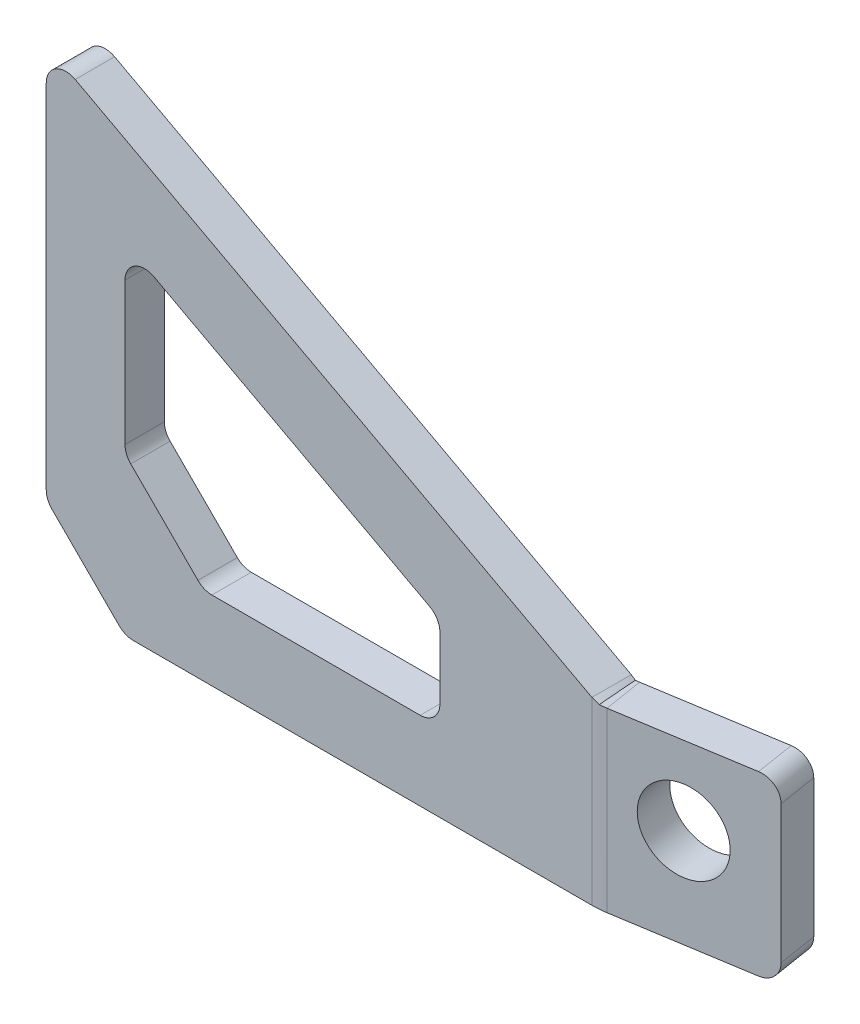
ISO-10303-21;
HEADER;
FILE_DESCRIPTION(('STEP AP214'),'2;1');
FILE_NAME('part.step','',(''),(''),'','','');
FILE_SCHEMA(('AUTOMOTIVE_DESIGN { 1 0 10303 214 1 1 1 1 }'));
ENDSEC;
DATA;
#1=APPLICATION_CONTEXT('core data for automotive mechanical design processes');
#2=APPLICATION_PROTOCOL_DEFINITION('international standard','automotive_design',2000,#1);
#3=PRODUCT_CONTEXT('',#1,'mechanical');
#4=PRODUCT('Part','Part','',(#3));
#5=PRODUCT_RELATED_PRODUCT_CATEGORY('part','',(#4));
#6=PRODUCT_DEFINITION_FORMATION('','',#4);
#7=PRODUCT_DEFINITION_CONTEXT('part definition',#1,'design');
#8=PRODUCT_DEFINITION('design','',#6,#7);
#9=PRODUCT_DEFINITION_SHAPE('','',#8);
#10=(LENGTH_UNIT() NAMED_UNIT(*) SI_UNIT(.MILLI.,.METRE.));
#11=(NAMED_UNIT(*) PLANE_ANGLE_UNIT() SI_UNIT($,.RADIAN.));
#12=(NAMED_UNIT(*) SI_UNIT($,.STERADIAN.) SOLID_ANGLE_UNIT());
#13=UNCERTAINTY_MEASURE_WITH_UNIT(LENGTH_MEASURE(1.E-05),#10,'distance_accuracy_value','');
#14=(GEOMETRIC_REPRESENTATION_CONTEXT(3) GLOBAL_UNCERTAINTY_ASSIGNED_CONTEXT((#13)) GLOBAL_UNIT_ASSIGNED_CONTEXT((#10,
#11,#12)) REPRESENTATION_CONTEXT('',''));
#15=CARTESIAN_POINT('',(0.,0.,0.));
#16=DIRECTION('',(0.,0.,1.));
#17=DIRECTION('',(1.,0.,0.));
#18=AXIS2_PLACEMENT_3D('',#15,#16,#17);
#19=CARTESIAN_POINT('',(88.4026185291436,28.575,-6.31050582149738));
#20=DIRECTION('',(0.,1.,0.));
#21=DIRECTION('',(0.157813385185794,0.,0.987468954173345));
#22=AXIS2_PLACEMENT_3D('',#19,#20,#21);
#23=PLANE('',#22);
#24=DIRECTION('',(-0.987468954173345,0.,0.157813385185794));
#25=VECTOR('',#24,1.);
#26=CARTESIAN_POINT('',(89.4047335250734,28.575,-0.0400779624966374));
#27=LINE('',#26,#25);
#28=CARTESIAN_POINT('',(111.351231031576,28.575,-3.54748044825091));
#29=VERTEX_POINT('',#28);
#30=CARTESIAN_POINT('',(90.2752249512932,28.575,-0.179196461530329));
#31=VERTEX_POINT('',#30);
#32=EDGE_CURVE('E260',#29,#31,#27,.T.);
#33=ORIENTED_EDGE('',*,*,#32,.F.);
#34=DIRECTION('',(0.157813385185794,0.,0.987468954173345));
#35=VECTOR('',#34,1.);
#36=CARTESIAN_POINT('',(110.349116035646,28.575,-9.81790830725165));
#37=LINE('',#36,#35);
#38=CARTESIAN_POINT('',(110.349116035646,28.575,-9.81790830725165));
#39=VERTEX_POINT('',#38);
#40=EDGE_CURVE('E312',#29,#39,#37,.F.);
#41=ORIENTED_EDGE('',*,*,#40,.T.);
#42=DIRECTION('',(-0.987468954173345,0.,0.157813385185794));
#43=VECTOR('',#42,1.);
#44=CARTESIAN_POINT('',(88.4026185291436,28.575,-6.31050582149738));
#45=LINE('',#44,#43);
#46=CARTESIAN_POINT('',(89.2731099553634,28.575,-6.44962432053107));
#47=VERTEX_POINT('',#46);
#48=EDGE_CURVE('E237',#39,#47,#45,.T.);
#49=ORIENTED_EDGE('',*,*,#48,.T.);
#50=DIRECTION('',(0.157813385185794,0.,0.987468954173345));
#51=VECTOR('',#50,1.);
#52=CARTESIAN_POINT('',(89.2731099553634,28.575,-6.44962432053107));
#53=LINE('',#52,#51);
#54=EDGE_CURVE('E270',#47,#31,#53,.T.);
#55=ORIENTED_EDGE('',*,*,#54,.T.);
#56=EDGE_LOOP('',(#33,#41,#49,#55));
#57=FACE_BOUND('',#56,.T.);
#58=ADVANCED_FACE('F55',(#57),#23,.T.);
#59=CARTESIAN_POINT('',(113.484329965147,0.,-10.3189658052165));
#60=DIRECTION('',(0.,-1.,0.));
#61=DIRECTION('',(-0.157813385185794,0.,-0.987468954173345));
#62=AXIS2_PLACEMENT_3D('',#59,#60,#61);
#63=PLANE('',#62);
#64=DIRECTION('',(0.987468954173345,0.,-0.157813385185794));
#65=VECTOR('',#64,1.);
#66=CARTESIAN_POINT('',(113.484329965147,0.,-10.3189658052165));
#67=LINE('',#66,#65);
#68=CARTESIAN_POINT('',(89.2731099553634,0.,-6.44962432053107));
#69=VERTEX_POINT('',#68);
#70=CARTESIAN_POINT('',(110.349116035646,0.,-9.81790830725165));
#71=VERTEX_POINT('',#70);
#72=EDGE_CURVE('E251',#69,#71,#67,.T.);
#73=ORIENTED_EDGE('',*,*,#72,.T.);
#74=DIRECTION('',(0.157813385185794,0.,0.987468954173345));
#75=VECTOR('',#74,1.);
#76=CARTESIAN_POINT('',(110.349116035646,0.,-9.81790830725165));
#77=LINE('',#76,#75);
#78=CARTESIAN_POINT('',(111.351231031576,0.,-3.54748044825091));
#79=VERTEX_POINT('',#78);
#80=EDGE_CURVE('E298',#71,#79,#77,.T.);
#81=ORIENTED_EDGE('',*,*,#80,.T.);
#82=DIRECTION('',(0.987468954173345,0.,-0.157813385185794));
#83=VECTOR('',#82,1.);
#84=CARTESIAN_POINT('',(114.486444961076,0.,-4.0485379462158));
#85=LINE('',#84,#83);
#86=CARTESIAN_POINT('',(90.2752249512932,0.,-0.179196461530329));
#87=VERTEX_POINT('',#86);
#88=EDGE_CURVE('E265',#87,#79,#85,.T.);
#89=ORIENTED_EDGE('',*,*,#88,.F.);
#90=DIRECTION('',(-0.157813385185794,0.,-0.987468954173345));
#91=VECTOR('',#90,1.);
#92=CARTESIAN_POINT('',(89.2731099553634,0.,-6.44962432053107));
#93=LINE('',#92,#91);
#94=EDGE_CURVE('E236',#87,#69,#93,.T.);
#95=ORIENTED_EDGE('',*,*,#94,.T.);
#96=EDGE_LOOP('',(#73,#81,#89,#95));
#97=FACE_BOUND('',#96,.T.);
#98=ADVANCED_FACE('F263',(#97),#63,.T.);
#99=CARTESIAN_POINT('',(0.616628503133213,0.,7.7191041215197));
#100=DIRECTION('',(-0.157813385185794,0.,-0.987468954173345));
#101=DIRECTION('',(-0.987468954173345,0.,0.157813385185794));
#102=AXIS2_PLACEMENT_3D('',#99,#100,#101);
#103=PLANE('',#102);
#104=CARTESIAN_POINT('',(99.940205789705,15.9258,-8.1543974140082));
#105=DIRECTION('',(-0.157813385185794,0.,-0.987468954173345));
#106=DIRECTION('',(-0.987468954173345,0.,0.157813385185794));
#107=AXIS2_PLACEMENT_3D('',#104,#105,#106);
#108=CIRCLE('',#107,6.54843750000001);
#109=CARTESIAN_POINT('',(93.4738270601105,15.9258,-7.1209663244556));
#110=VERTEX_POINT('',#109);
#111=EDGE_CURVE('E286',#110,#110,#108,.T.);
#112=ORIENTED_EDGE('',*,*,#111,.F.);
#113=EDGE_LOOP('',(#112));
#114=FACE_BOUND('',#113,.T.);
#115=DIRECTION('',(0.,1.,0.));
#116=VECTOR('',#115,1.);
#117=CARTESIAN_POINT('',(113.484329965147,28.575,-10.3189658052165));
#118=LINE('',#117,#116);
#119=CARTESIAN_POINT('',(113.484329965147,3.175,-10.3189658052165));
#120=VERTEX_POINT('',#119);
#121=CARTESIAN_POINT('',(113.484329965147,25.4,-10.3189658052165));
#122=VERTEX_POINT('',#121);
#123=EDGE_CURVE('E259',#120,#122,#118,.T.);
#124=ORIENTED_EDGE('',*,*,#123,.F.);
#125=CARTESIAN_POINT('',(110.349116035646,3.175,-9.81790830725165));
#126=DIRECTION('',(-0.157813385185794,0.,-0.987468954173345));
#127=DIRECTION('',(-0.987468954173345,0.,0.157813385185794));
#128=AXIS2_PLACEMENT_3D('',#125,#126,#127);
#129=CIRCLE('',#128,3.175);
#130=EDGE_CURVE('E255',#120,#71,#129,.T.);
#131=ORIENTED_EDGE('',*,*,#130,.T.);
#132=ORIENTED_EDGE('',*,*,#72,.F.);
#133=DIRECTION('',(0.,1.,0.));
#134=VECTOR('',#133,1.);
#135=CARTESIAN_POINT('',(89.2731099553634,0.,-6.44962432053107));
#136=LINE('',#135,#134);
#137=EDGE_CURVE('E224',#69,#47,#136,.T.);
#138=ORIENTED_EDGE('',*,*,#137,.T.);
#139=ORIENTED_EDGE('',*,*,#48,.F.);
#140=CARTESIAN_POINT('',(110.349116035646,25.4,-9.81790830725165));
#141=DIRECTION('',(-0.157813385185794,0.,-0.987468954173345));
#142=DIRECTION('',(-0.987468954173345,0.,0.157813385185794));
#143=AXIS2_PLACEMENT_3D('',#140,#141,#142);
#144=CIRCLE('',#143,3.175);
#145=EDGE_CURVE('E309',#39,#122,#144,.T.);
#146=ORIENTED_EDGE('',*,*,#145,.T.);
#147=EDGE_LOOP('',(#124,#131,#132,#138,#139,#146));
#148=FACE_BOUND('',#147,.T.);
#149=ADVANCED_FACE('F253',(#114,#148),#103,.T.);
#150=CARTESIAN_POINT('',(113.484329965147,28.575,-10.3189658052165));
#151=DIRECTION('',(0.987468954173345,0.,-0.157813385185794));
#152=DIRECTION('',(0.,1.,0.));
#153=AXIS2_PLACEMENT_3D('',#150,#151,#152);
#154=PLANE('',#153);
#155=DIRECTION('',(0.,1.,0.));
#156=VECTOR('',#155,1.);
#157=CARTESIAN_POINT('',(114.486444961076,28.575,-4.0485379462158));
#158=LINE('',#157,#156);
#159=CARTESIAN_POINT('',(114.486444961076,3.175,-4.0485379462158));
#160=VERTEX_POINT('',#159);
#161=CARTESIAN_POINT('',(114.486444961076,25.4,-4.0485379462158));
#162=VERTEX_POINT('',#161);
#163=EDGE_CURVE('E279',#160,#162,#158,.T.);
#164=ORIENTED_EDGE('',*,*,#163,.F.);
#165=DIRECTION('',(0.157813385185794,0.,0.987468954173345));
#166=VECTOR('',#165,1.);
#167=CARTESIAN_POINT('',(113.484329965147,3.175,-10.3189658052165));
#168=LINE('',#167,#166);
#169=EDGE_CURVE('E307',#160,#120,#168,.F.);
#170=ORIENTED_EDGE('',*,*,#169,.T.);
#171=ORIENTED_EDGE('',*,*,#123,.T.);
#172=DIRECTION('',(0.157813385185794,0.,0.987468954173345));
#173=VECTOR('',#172,1.);
#174=CARTESIAN_POINT('',(113.484329965147,25.4,-10.3189658052165));
#175=LINE('',#174,#173);
#176=EDGE_CURVE('E304',#122,#162,#175,.T.);
#177=ORIENTED_EDGE('',*,*,#176,.T.);
#178=EDGE_LOOP('',(#164,#170,#171,#177));
#179=FACE_BOUND('',#178,.T.);
#180=ADVANCED_FACE('F462',(#179),#154,.T.);
#181=CARTESIAN_POINT('',(1.618743499063,0.,13.9895319805204));
#182=DIRECTION('',(-0.157813385185794,0.,-0.987468954173345));
#183=DIRECTION('',(-0.987468954173345,0.,0.157813385185794));
#184=AXIS2_PLACEMENT_3D('',#181,#182,#183);
#185=PLANE('',#184);
#186=CARTESIAN_POINT('',(100.942320785635,15.9258,-1.88396955500745));
#187=DIRECTION('',(-0.157813385185794,0.,-0.987468954173345));
#188=DIRECTION('',(-0.987468954173345,0.,0.157813385185794));
#189=AXIS2_PLACEMENT_3D('',#186,#187,#188);
#190=CIRCLE('',#189,6.54843750000001);
#191=CARTESIAN_POINT('',(94.4759420560403,15.9258,-0.850538465454855));
#192=VERTEX_POINT('',#191);
#193=EDGE_CURVE('E282',#192,#192,#190,.T.);
#194=ORIENTED_EDGE('',*,*,#193,.T.);
#195=EDGE_LOOP('',(#194));
#196=FACE_BOUND('',#195,.T.);
#197=ORIENTED_EDGE('',*,*,#88,.T.);
#198=CARTESIAN_POINT('',(111.351231031576,3.175,-3.54748044825091));
#199=DIRECTION('',(-0.157813385185794,0.,-0.987468954173345));
#200=DIRECTION('',(-0.987468954173345,0.,0.157813385185794));
#201=AXIS2_PLACEMENT_3D('',#198,#199,#200);
#202=CIRCLE('',#201,3.175);
#203=EDGE_CURVE('E302',#79,#160,#202,.F.);
#204=ORIENTED_EDGE('',*,*,#203,.T.);
#205=ORIENTED_EDGE('',*,*,#163,.T.);
#206=CARTESIAN_POINT('',(111.351231031576,25.4,-3.54748044825091));
#207=DIRECTION('',(-0.157813385185794,0.,-0.987468954173345));
#208=DIRECTION('',(-0.987468954173345,0.,0.157813385185794));
#209=AXIS2_PLACEMENT_3D('',#206,#207,#208);
#210=CIRCLE('',#209,3.175);
#211=EDGE_CURVE('E300',#162,#29,#210,.F.);
#212=ORIENTED_EDGE('',*,*,#211,.T.);
#213=ORIENTED_EDGE('',*,*,#32,.T.);
#214=DIRECTION('',(0.,1.,0.));
#215=VECTOR('',#214,1.);
#216=CARTESIAN_POINT('',(90.2752249512932,0.,-0.179196461530327));
#217=LINE('',#216,#215);
#218=EDGE_CURVE('E267',#87,#31,#217,.T.);
#219=ORIENTED_EDGE('',*,*,#218,.F.);
#220=EDGE_LOOP('',(#197,#204,#205,#212,#213,#219));
#221=FACE_BOUND('',#220,.T.);
#222=ADVANCED_FACE('F465',(#196,#221),#185,.F.);
#223=CARTESIAN_POINT('',(63.5,12.7,-6.35));
#224=DIRECTION('',(1.,0.,0.));
#225=DIRECTION('',(0.,0.,-1.));
#226=AXIS2_PLACEMENT_3D('',#223,#224,#225);
#227=PLANE('',#226);
#228=DIRECTION('',(0.,1.,0.));
#229=VECTOR('',#228,1.);
#230=CARTESIAN_POINT('',(63.5,12.7,-6.35));
#231=LINE('',#230,#229);
#232=CARTESIAN_POINT('',(63.5,15.875,-6.35));
#233=VERTEX_POINT('',#232);
#234=CARTESIAN_POINT('',(63.5,25.8735510523919,-6.35));
#235=VERTEX_POINT('',#234);
#236=EDGE_CURVE('E402',#233,#235,#231,.T.);
#237=ORIENTED_EDGE('',*,*,#236,.F.);
#238=DIRECTION('',(0.,0.,1.));
#239=VECTOR('',#238,1.);
#240=CARTESIAN_POINT('',(63.5,15.875,0.));
#241=LINE('',#240,#239);
#242=CARTESIAN_POINT('',(63.5,15.875,0.));
#243=VERTEX_POINT('',#242);
#244=EDGE_CURVE('E342',#233,#243,#241,.T.);
#245=ORIENTED_EDGE('',*,*,#244,.T.);
#246=DIRECTION('',(0.,1.,0.));
#247=VECTOR('',#246,1.);
#248=CARTESIAN_POINT('',(63.5,12.7,0.));
#249=LINE('',#248,#247);
#250=CARTESIAN_POINT('',(63.5,25.8735510523919,0.));
#251=VERTEX_POINT('',#250);
#252=EDGE_CURVE('E424',#243,#251,#249,.T.);
#253=ORIENTED_EDGE('',*,*,#252,.T.);
#254=DIRECTION('',(0.,0.,1.));
#255=VECTOR('',#254,1.);
#256=CARTESIAN_POINT('',(63.5,25.8735510523919,-6.35));
#257=LINE('',#256,#255);
#258=EDGE_CURVE('E70',#251,#235,#257,.F.);
#259=ORIENTED_EDGE('',*,*,#258,.T.);
#260=EDGE_LOOP('',(#237,#245,#253,#259));
#261=FACE_BOUND('',#260,.T.);
#262=ADVANCED_FACE('F474',(#261),#227,.F.);
#263=CARTESIAN_POINT('',(12.7,12.7,-6.35));
#264=DIRECTION('',(0.,-1.,0.));
#265=DIRECTION('',(1.,0.,0.));
#266=AXIS2_PLACEMENT_3D('',#263,#264,#265);
#267=PLANE('',#266);
#268=DIRECTION('',(1.,0.,0.));
#269=VECTOR('',#268,1.);
#270=CARTESIAN_POINT('',(12.7,12.7,0.));
#271=LINE('',#270,#269);
#272=CARTESIAN_POINT('',(26.7151280605346,12.7,0.));
#273=VERTEX_POINT('',#272);
#274=CARTESIAN_POINT('',(60.325,12.7,0.));
#275=VERTEX_POINT('',#274);
#276=EDGE_CURVE('E387',#273,#275,#271,.T.);
#277=ORIENTED_EDGE('',*,*,#276,.T.);
#278=DIRECTION('',(0.,0.,1.));
#279=VECTOR('',#278,1.);
#280=CARTESIAN_POINT('',(60.325,12.7,-6.35));
#281=LINE('',#280,#279);
#282=CARTESIAN_POINT('',(60.325,12.7,-6.35));
#283=VERTEX_POINT('',#282);
#284=EDGE_CURVE('E348',#275,#283,#281,.F.);
#285=ORIENTED_EDGE('',*,*,#284,.T.);
#286=DIRECTION('',(1.,0.,0.));
#287=VECTOR('',#286,1.);
#288=CARTESIAN_POINT('',(12.7,12.7,-6.35));
#289=LINE('',#288,#287);
#290=CARTESIAN_POINT('',(26.7151280605346,12.7,-6.35));
#291=VERTEX_POINT('',#290);
#292=EDGE_CURVE('E398',#291,#283,#289,.T.);
#293=ORIENTED_EDGE('',*,*,#292,.F.);
#294=DIRECTION('',(0.,0.,-1.));
#295=VECTOR('',#294,1.);
#296=CARTESIAN_POINT('',(26.7151280605346,12.7,0.));
#297=LINE('',#296,#295);
#298=EDGE_CURVE('E345',#291,#273,#297,.F.);
#299=ORIENTED_EDGE('',*,*,#298,.T.);
#300=EDGE_LOOP('',(#277,#285,#293,#299));
#301=FACE_BOUND('',#300,.T.);
#302=ADVANCED_FACE('F400',(#301),#267,.F.);
#303=CARTESIAN_POINT('',(12.7,54.9888408419135,-6.35));
#304=DIRECTION('',(-1.,0.,0.));
#305=DIRECTION('',(0.,-1.,0.));
#306=AXIS2_PLACEMENT_3D('',#303,#304,#305);
#307=PLANE('',#306);
#308=DIRECTION('',(0.,-1.,0.));
#309=VECTOR('',#308,1.);
#310=CARTESIAN_POINT('',(12.7,54.9888408419135,-6.35));
#311=LINE('',#310,#309);
#312=CARTESIAN_POINT('',(12.7,49.6860510523919,-6.35));
#313=VERTEX_POINT('',#312);
#314=CARTESIAN_POINT('',(12.7,26.7151280605345,-6.35));
#315=VERTEX_POINT('',#314);
#316=EDGE_CURVE('E403',#313,#315,#311,.T.);
#317=ORIENTED_EDGE('',*,*,#316,.F.);
#318=DIRECTION('',(0.,0.,1.));
#319=VECTOR('',#318,1.);
#320=CARTESIAN_POINT('',(12.7,49.6860510523919,0.));
#321=LINE('',#320,#319);
#322=CARTESIAN_POINT('',(12.7,49.6860510523919,0.));
#323=VERTEX_POINT('',#322);
#324=EDGE_CURVE('E358',#313,#323,#321,.T.);
#325=ORIENTED_EDGE('',*,*,#324,.T.);
#326=DIRECTION('',(0.,-1.,0.));
#327=VECTOR('',#326,1.);
#328=CARTESIAN_POINT('',(12.7,54.9888408419135,0.));
#329=LINE('',#328,#327);
#330=CARTESIAN_POINT('',(12.7,26.7151280605345,0.));
#331=VERTEX_POINT('',#330);
#332=EDGE_CURVE('E420',#323,#331,#329,.T.);
#333=ORIENTED_EDGE('',*,*,#332,.T.);
#334=DIRECTION('',(0.,0.,1.));
#335=VECTOR('',#334,1.);
#336=CARTESIAN_POINT('',(12.7,26.7151280605345,-6.35));
#337=LINE('',#336,#335);
#338=EDGE_CURVE('E355',#331,#315,#337,.F.);
#339=ORIENTED_EDGE('',*,*,#338,.T.);
#340=EDGE_LOOP('',(#317,#325,#333,#339));
#341=FACE_BOUND('',#340,.T.);
#342=ADVANCED_FACE('F526',(#341),#307,.F.);
#343=CARTESIAN_POINT('',(63.5,27.7745551276278,-6.35));
#344=DIRECTION('',(0.472221412515419,0.881479970028782,0.));
#345=DIRECTION('',(-0.881479970028782,0.472221412515419,0.));
#346=AXIS2_PLACEMENT_3D('',#343,#344,#345);
#347=PLANE('',#346);
#348=DIRECTION('',(-0.881479970028782,0.472221412515419,0.));
#349=VECTOR('',#348,1.);
#350=CARTESIAN_POINT('',(63.5,27.7745551276278,-6.35));
#351=LINE('',#350,#349);
#352=CARTESIAN_POINT('',(61.8243029847365,28.6722499572332,-6.35));
#353=VERTEX_POINT('',#352);
#354=CARTESIAN_POINT('',(17.3743029847364,52.4847499572332,-6.35));
#355=VERTEX_POINT('',#354);
#356=EDGE_CURVE('E408',#353,#355,#351,.T.);
#357=ORIENTED_EDGE('',*,*,#356,.F.);
#358=DIRECTION('',(0.,0.,1.));
#359=VECTOR('',#358,1.);
#360=CARTESIAN_POINT('',(61.8243029847365,28.6722499572332,0.));
#361=LINE('',#360,#359);
#362=CARTESIAN_POINT('',(61.8243029847365,28.6722499572332,0.));
#363=VERTEX_POINT('',#362);
#364=EDGE_CURVE('E352',#353,#363,#361,.T.);
#365=ORIENTED_EDGE('',*,*,#364,.T.);
#366=DIRECTION('',(-0.881479970028782,0.472221412515419,0.));
#367=VECTOR('',#366,1.);
#368=CARTESIAN_POINT('',(63.5,27.7745551276278,0.));
#369=LINE('',#368,#367);
#370=CARTESIAN_POINT('',(17.3743029847364,52.4847499572332,0.));
#371=VERTEX_POINT('',#370);
#372=EDGE_CURVE('E417',#363,#371,#369,.T.);
#373=ORIENTED_EDGE('',*,*,#372,.T.);
#374=DIRECTION('',(0.,0.,1.));
#375=VECTOR('',#374,1.);
#376=CARTESIAN_POINT('',(17.3743029847364,52.4847499572332,-6.35));
#377=LINE('',#376,#375);
#378=EDGE_CURVE('E350',#371,#355,#377,.F.);
#379=ORIENTED_EDGE('',*,*,#378,.T.);
#380=EDGE_LOOP('',(#357,#365,#373,#379));
#381=FACE_BOUND('',#380,.T.);
#382=ADVANCED_FACE('F533',(#381),#347,.F.);
#383=CARTESIAN_POINT('',(0.,0.,-6.35));
#384=DIRECTION('',(-1.,0.,0.));
#385=DIRECTION('',(0.,0.,1.));
#386=AXIS2_PLACEMENT_3D('',#383,#384,#385);
#387=PLANE('',#386);
#388=DIRECTION('',(0.,-1.,0.));
#389=VECTOR('',#388,1.);
#390=CARTESIAN_POINT('',(0.,0.,0.));
#391=LINE('',#390,#389);
#392=CARTESIAN_POINT('',(0.,70.8972102104783,0.));
#393=VERTEX_POINT('',#392);
#394=CARTESIAN_POINT('',(0.,14.0151280605346,0.));
#395=VERTEX_POINT('',#394);
#396=EDGE_CURVE('E431',#393,#395,#391,.T.);
#397=ORIENTED_EDGE('',*,*,#396,.F.);
#398=DIRECTION('',(0.,0.,1.));
#399=VECTOR('',#398,1.);
#400=CARTESIAN_POINT('',(0.,70.8972102104784,-6.35));
#401=LINE('',#400,#399);
#402=CARTESIAN_POINT('',(0.,70.8972102104783,-6.35));
#403=VERTEX_POINT('',#402);
#404=EDGE_CURVE('E326',#393,#403,#401,.F.);
#405=ORIENTED_EDGE('',*,*,#404,.T.);
#406=DIRECTION('',(0.,-1.,0.));
#407=VECTOR('',#406,1.);
#408=CARTESIAN_POINT('',(0.,0.,-6.35));
#409=LINE('',#408,#407);
#410=CARTESIAN_POINT('',(0.,14.0151280605346,-6.35));
#411=VERTEX_POINT('',#410);
#412=EDGE_CURVE('E414',#403,#411,#409,.T.);
#413=ORIENTED_EDGE('',*,*,#412,.T.);
#414=DIRECTION('',(0.,0.,-1.));
#415=VECTOR('',#414,1.);
#416=CARTESIAN_POINT('',(0.,14.0151280605346,-6.35));
#417=LINE('',#416,#415);
#418=EDGE_CURVE('E323',#411,#395,#417,.F.);
#419=ORIENTED_EDGE('',*,*,#418,.T.);
#420=EDGE_LOOP('',(#397,#405,#413,#419));
#421=FACE_BOUND('',#420,.T.);
#422=ADVANCED_FACE('F553',(#421),#387,.T.);
#423=CARTESIAN_POINT('',(0.,0.,-6.35));
#424=DIRECTION('',(0.,0.,-1.));
#425=DIRECTION('',(-1.,0.,0.));
#426=AXIS2_PLACEMENT_3D('',#423,#424,#425);
#427=PLANE('',#426);
#428=ORIENTED_EDGE('',*,*,#412,.F.);
#429=CARTESIAN_POINT('',(3.175,70.8972102104784,-6.35));
#430=DIRECTION('',(0.,0.,-1.));
#431=DIRECTION('',(-1.,0.,0.));
#432=AXIS2_PLACEMENT_3D('',#429,#430,#431);
#433=CIRCLE('',#432,3.175);
#434=CARTESIAN_POINT('',(4.67430298473646,73.6959091153198,-6.35));
#435=VERTEX_POINT('',#434);
#436=EDGE_CURVE('E332',#403,#435,#433,.T.);
#437=ORIENTED_EDGE('',*,*,#436,.T.);
#438=DIRECTION('',(-0.881479970028782,0.472221412515419,0.));
#439=VECTOR('',#438,1.);
#440=CARTESIAN_POINT('',(0.,76.2,-6.35));
#441=LINE('',#440,#439);
#442=CARTESIAN_POINT('',(88.0184619804593,29.0472525104682,-6.35));
#443=VERTEX_POINT('',#442);
#444=EDGE_CURVE('E280',#443,#435,#441,.T.);
#445=ORIENTED_EDGE('',*,*,#444,.F.);
#446=DIRECTION('',(0.,1.,0.));
#447=VECTOR('',#446,1.);
#448=CARTESIAN_POINT('',(88.0184619804593,0.,-6.35));
#449=LINE('',#448,#447);
#450=CARTESIAN_POINT('',(88.0184619804593,0.,-6.35));
#451=VERTEX_POINT('',#450);
#452=EDGE_CURVE('E449',#451,#443,#449,.T.);
#453=ORIENTED_EDGE('',*,*,#452,.F.);
#454=DIRECTION('',(1.,0.,0.));
#455=VECTOR('',#454,1.);
#456=CARTESIAN_POINT('',(114.3,0.,-6.35));
#457=LINE('',#456,#455);
#458=CARTESIAN_POINT('',(14.0151280605346,0.,-6.35));
#459=VERTEX_POINT('',#458);
#460=EDGE_CURVE('E405',#459,#451,#457,.T.);
#461=ORIENTED_EDGE('',*,*,#460,.F.);
#462=CARTESIAN_POINT('',(14.0151280605346,3.175,-6.35));
#463=DIRECTION('',(0.,0.,-1.));
#464=DIRECTION('',(-1.,0.,0.));
#465=AXIS2_PLACEMENT_3D('',#462,#463,#464);
#466=CIRCLE('',#465,3.175);
#467=CARTESIAN_POINT('',(11.7700640302673,0.929935969732714,-6.35));
#468=VERTEX_POINT('',#467);
#469=EDGE_CURVE('E328',#459,#468,#466,.T.);
#470=ORIENTED_EDGE('',*,*,#469,.T.);
#471=DIRECTION('',(0.707106781186549,-0.707106781186546,0.));
#472=VECTOR('',#471,1.);
#473=CARTESIAN_POINT('',(6.34999999999999,6.35000000000002,-6.35));
#474=LINE('',#473,#472);
#475=CARTESIAN_POINT('',(0.929935969732714,11.7700640302673,-6.35));
#476=VERTEX_POINT('',#475);
#477=EDGE_CURVE('E289',#468,#476,#474,.F.);
#478=ORIENTED_EDGE('',*,*,#477,.T.);
#479=CARTESIAN_POINT('',(3.175,14.0151280605346,-6.35));
#480=DIRECTION('',(0.,0.,-1.));
#481=DIRECTION('',(-1.,0.,0.));
#482=AXIS2_PLACEMENT_3D('',#479,#480,#481);
#483=CIRCLE('',#482,3.175);
#484=EDGE_CURVE('E330',#476,#411,#483,.T.);
#485=ORIENTED_EDGE('',*,*,#484,.T.);
#486=EDGE_LOOP('',(#428,#437,#445,#453,#461,#470,#478,#485));
#487=FACE_BOUND('',#486,.T.);
#488=ORIENTED_EDGE('',*,*,#236,.T.);
#489=CARTESIAN_POINT('',(60.325,25.8735510523919,-6.35));
#490=DIRECTION('',(0.,0.,-1.));
#491=DIRECTION('',(-1.,0.,0.));
#492=AXIS2_PLACEMENT_3D('',#489,#490,#491);
#493=CIRCLE('',#492,3.175);
#494=EDGE_CURVE('E370',#235,#353,#493,.F.);
#495=ORIENTED_EDGE('',*,*,#494,.T.);
#496=ORIENTED_EDGE('',*,*,#356,.T.);
#497=CARTESIAN_POINT('',(15.875,49.6860510523919,-6.35));
#498=DIRECTION('',(0.,0.,-1.));
#499=DIRECTION('',(-1.,0.,0.));
#500=AXIS2_PLACEMENT_3D('',#497,#498,#499);
#501=CIRCLE('',#500,3.175);
#502=EDGE_CURVE('E374',#355,#313,#501,.F.);
#503=ORIENTED_EDGE('',*,*,#502,.T.);
#504=ORIENTED_EDGE('',*,*,#316,.T.);
#505=CARTESIAN_POINT('',(15.875,26.7151280605345,-6.35));
#506=DIRECTION('',(0.,0.,-1.));
#507=DIRECTION('',(-1.,0.,0.));
#508=AXIS2_PLACEMENT_3D('',#505,#506,#507);
#509=CIRCLE('',#508,3.175);
#510=CARTESIAN_POINT('',(13.6299359697327,24.4700640302672,-6.35));
#511=VERTEX_POINT('',#510);
#512=EDGE_CURVE('E376',#315,#511,#509,.F.);
#513=ORIENTED_EDGE('',*,*,#512,.T.);
#514=DIRECTION('',(-0.707106781186551,0.707106781186544,0.));
#515=VECTOR('',#514,1.);
#516=CARTESIAN_POINT('',(25.4000000000001,12.7,-6.35));
#517=LINE('',#516,#515);
#518=CARTESIAN_POINT('',(24.4700640302674,13.6299359697327,-6.35));
#519=VERTEX_POINT('',#518);
#520=EDGE_CURVE('E295',#511,#519,#517,.F.);
#521=ORIENTED_EDGE('',*,*,#520,.T.);
#522=CARTESIAN_POINT('',(26.7151280605346,15.875,-6.35));
#523=DIRECTION('',(0.,0.,-1.));
#524=DIRECTION('',(-1.,0.,0.));
#525=AXIS2_PLACEMENT_3D('',#522,#523,#524);
#526=CIRCLE('',#525,3.175);
#527=EDGE_CURVE('E12',#519,#291,#526,.F.);
#528=ORIENTED_EDGE('',*,*,#527,.T.);
#529=ORIENTED_EDGE('',*,*,#292,.T.);
#530=CARTESIAN_POINT('',(60.325,15.875,-6.35));
#531=DIRECTION('',(0.,0.,-1.));
#532=DIRECTION('',(-1.,0.,0.));
#533=AXIS2_PLACEMENT_3D('',#530,#531,#532);
#534=CIRCLE('',#533,3.175);
#535=EDGE_CURVE('E77',#283,#233,#534,.F.);
#536=ORIENTED_EDGE('',*,*,#535,.T.);
#537=EDGE_LOOP('',(#488,#495,#496,#503,#504,#513,#521,#528,#529,#536));
#538=FACE_BOUND('',#537,.T.);
#539=ADVANCED_FACE('F397',(#487,#538),#427,.T.);
#540=CARTESIAN_POINT('',(114.3,0.,-6.35));
#541=DIRECTION('',(0.,-1.,0.));
#542=DIRECTION('',(0.,0.,-1.));
#543=AXIS2_PLACEMENT_3D('',#540,#541,#542);
#544=PLANE('',#543);
#545=DIRECTION('',(1.,0.,0.));
#546=VECTOR('',#545,1.);
#547=CARTESIAN_POINT('',(114.3,0.,0.));
#548=LINE('',#547,#546);
#549=CARTESIAN_POINT('',(14.0151280605346,0.,0.));
#550=VERTEX_POINT('',#549);
#551=CARTESIAN_POINT('',(88.0184619804593,0.,0.));
#552=VERTEX_POINT('',#551);
#553=EDGE_CURVE('E437',#550,#552,#548,.T.);
#554=ORIENTED_EDGE('',*,*,#553,.F.);
#555=DIRECTION('',(0.,0.,1.));
#556=VECTOR('',#555,1.);
#557=CARTESIAN_POINT('',(14.0151280605346,0.,-6.35));
#558=LINE('',#557,#556);
#559=EDGE_CURVE('E338',#550,#459,#558,.F.);
#560=ORIENTED_EDGE('',*,*,#559,.T.);
#561=ORIENTED_EDGE('',*,*,#460,.T.);
#562=DIRECTION('',(0.,0.,-1.));
#563=VECTOR('',#562,1.);
#564=CARTESIAN_POINT('',(88.0184619804593,0.,-6.35));
#565=LINE('',#564,#563);
#566=EDGE_CURVE('E246',#552,#451,#565,.T.);
#567=ORIENTED_EDGE('',*,*,#566,.F.);
#568=EDGE_LOOP('',(#554,#560,#561,#567));
#569=FACE_BOUND('',#568,.T.);
#570=ADVANCED_FACE('F558',(#569),#544,.T.);
#571=CARTESIAN_POINT('',(0.,0.,0.));
#572=DIRECTION('',(0.,0.,-1.));
#573=DIRECTION('',(-1.,0.,0.));
#574=AXIS2_PLACEMENT_3D('',#571,#572,#573);
#575=PLANE('',#574);
#576=ORIENTED_EDGE('',*,*,#332,.F.);
#577=CARTESIAN_POINT('',(15.875,49.6860510523919,0.));
#578=DIRECTION('',(0.,0.,-1.));
#579=DIRECTION('',(-1.,0.,0.));
#580=AXIS2_PLACEMENT_3D('',#577,#578,#579);
#581=CIRCLE('',#580,3.175);
#582=EDGE_CURVE('E372',#323,#371,#581,.T.);
#583=ORIENTED_EDGE('',*,*,#582,.T.);
#584=ORIENTED_EDGE('',*,*,#372,.F.);
#585=CARTESIAN_POINT('',(60.325,25.8735510523919,0.));
#586=DIRECTION('',(0.,0.,-1.));
#587=DIRECTION('',(-1.,0.,0.));
#588=AXIS2_PLACEMENT_3D('',#585,#586,#587);
#589=CIRCLE('',#588,3.175);
#590=EDGE_CURVE('E368',#363,#251,#589,.T.);
#591=ORIENTED_EDGE('',*,*,#590,.T.);
#592=ORIENTED_EDGE('',*,*,#252,.F.);
#593=CARTESIAN_POINT('',(60.325,15.875,0.));
#594=DIRECTION('',(0.,0.,-1.));
#595=DIRECTION('',(-1.,0.,0.));
#596=AXIS2_PLACEMENT_3D('',#593,#594,#595);
#597=CIRCLE('',#596,3.175);
#598=EDGE_CURVE('E365',#243,#275,#597,.T.);
#599=ORIENTED_EDGE('',*,*,#598,.T.);
#600=ORIENTED_EDGE('',*,*,#276,.F.);
#601=CARTESIAN_POINT('',(26.7151280605346,15.875,0.));
#602=DIRECTION('',(0.,0.,-1.));
#603=DIRECTION('',(-1.,0.,0.));
#604=AXIS2_PLACEMENT_3D('',#601,#602,#603);
#605=CIRCLE('',#604,3.175);
#606=CARTESIAN_POINT('',(24.4700640302674,13.6299359697327,0.));
#607=VERTEX_POINT('',#606);
#608=EDGE_CURVE('E63',#273,#607,#605,.T.);
#609=ORIENTED_EDGE('',*,*,#608,.T.);
#610=DIRECTION('',(0.707106781186551,-0.707106781186544,0.));
#611=VECTOR('',#610,1.);
#612=CARTESIAN_POINT('',(19.0499999999999,19.0500000000001,0.));
#613=LINE('',#612,#611);
#614=CARTESIAN_POINT('',(13.6299359697327,24.4700640302672,0.));
#615=VERTEX_POINT('',#614);
#616=EDGE_CURVE('E292',#607,#615,#613,.F.);
#617=ORIENTED_EDGE('',*,*,#616,.T.);
#618=CARTESIAN_POINT('',(15.875,26.7151280605345,0.));
#619=DIRECTION('',(0.,0.,-1.));
#620=DIRECTION('',(-1.,0.,0.));
#621=AXIS2_PLACEMENT_3D('',#618,#619,#620);
#622=CIRCLE('',#621,3.175);
#623=EDGE_CURVE('E378',#615,#331,#622,.T.);
#624=ORIENTED_EDGE('',*,*,#623,.T.);
#625=EDGE_LOOP('',(#576,#583,#584,#591,#592,#599,#600,#609,#617,#624));
#626=FACE_BOUND('',#625,.T.);
#627=DIRECTION('',(-0.881479970028782,0.472221412515419,0.));
#628=VECTOR('',#627,1.);
#629=CARTESIAN_POINT('',(0.,76.2,0.));
#630=LINE('',#629,#628);
#631=CARTESIAN_POINT('',(88.0184619804593,29.0472525104682,0.));
#632=VERTEX_POINT('',#631);
#633=CARTESIAN_POINT('',(4.67430298473646,73.6959091153198,0.));
#634=VERTEX_POINT('',#633);
#635=EDGE_CURVE('E428',#632,#634,#630,.T.);
#636=ORIENTED_EDGE('',*,*,#635,.T.);
#637=CARTESIAN_POINT('',(3.175,70.8972102104784,0.));
#638=DIRECTION('',(0.,0.,-1.));
#639=DIRECTION('',(-1.,0.,0.));
#640=AXIS2_PLACEMENT_3D('',#637,#638,#639);
#641=CIRCLE('',#640,3.175);
#642=EDGE_CURVE('E321',#634,#393,#641,.F.);
#643=ORIENTED_EDGE('',*,*,#642,.T.);
#644=ORIENTED_EDGE('',*,*,#396,.T.);
#645=CARTESIAN_POINT('',(3.175,14.0151280605346,0.));
#646=DIRECTION('',(0.,0.,-1.));
#647=DIRECTION('',(-1.,0.,0.));
#648=AXIS2_PLACEMENT_3D('',#645,#646,#647);
#649=CIRCLE('',#648,3.175);
#650=CARTESIAN_POINT('',(0.929935969732714,11.7700640302673,0.));
#651=VERTEX_POINT('',#650);
#652=EDGE_CURVE('E319',#395,#651,#649,.F.);
#653=ORIENTED_EDGE('',*,*,#652,.T.);
#654=DIRECTION('',(-0.707106781186549,0.707106781186546,0.));
#655=VECTOR('',#654,1.);
#656=CARTESIAN_POINT('',(0.,12.7,0.));
#657=LINE('',#656,#655);
#658=CARTESIAN_POINT('',(11.7700640302673,0.929935969732714,0.));
#659=VERTEX_POINT('',#658);
#660=EDGE_CURVE('E276',#651,#659,#657,.F.);
#661=ORIENTED_EDGE('',*,*,#660,.T.);
#662=CARTESIAN_POINT('',(14.0151280605346,3.175,0.));
#663=DIRECTION('',(0.,0.,-1.));
#664=DIRECTION('',(-1.,0.,0.));
#665=AXIS2_PLACEMENT_3D('',#662,#663,#664);
#666=CIRCLE('',#665,3.175);
#667=EDGE_CURVE('E317',#659,#550,#666,.F.);
#668=ORIENTED_EDGE('',*,*,#667,.T.);
#669=ORIENTED_EDGE('',*,*,#553,.T.);
#670=DIRECTION('',(0.,1.,0.));
#671=VECTOR('',#670,1.);
#672=CARTESIAN_POINT('',(88.0184619804593,0.,0.));
#673=LINE('',#672,#671);
#674=EDGE_CURVE('E432',#552,#632,#673,.T.);
#675=ORIENTED_EDGE('',*,*,#674,.T.);
#676=EDGE_LOOP('',(#636,#643,#644,#653,#661,#668,#669,#675));
#677=FACE_BOUND('',#676,.T.);
#678=ADVANCED_FACE('F383',(#626,#677),#575,.F.);
#679=CARTESIAN_POINT('',(0.,76.2,-6.35));
#680=DIRECTION('',(0.472221412515419,0.881479970028782,0.));
#681=DIRECTION('',(-0.881479970028782,0.472221412515419,0.));
#682=AXIS2_PLACEMENT_3D('',#679,#680,#681);
#683=PLANE('',#682);
#684=ORIENTED_EDGE('',*,*,#444,.T.);
#685=DIRECTION('',(0.,0.,1.));
#686=VECTOR('',#685,1.);
#687=CARTESIAN_POINT('',(4.67430298473646,73.6959091153198,-6.35));
#688=LINE('',#687,#686);
#689=EDGE_CURVE('E314',#435,#634,#688,.T.);
#690=ORIENTED_EDGE('',*,*,#689,.T.);
#691=ORIENTED_EDGE('',*,*,#635,.F.);
#692=CARTESIAN_POINT('',(88.0184619804593,29.0472525104682,-6.35));
#693=CARTESIAN_POINT('',(88.0184619804593,29.0472525104682,0.));
#694=B_SPLINE_CURVE_WITH_KNOTS('',1,(#692,#693),.UNSPECIFIED.,.F.,.F.,(2,2),(0.,1.),.UNSPECIFIED.);
#695=EDGE_CURVE('E427',#443,#632,#694,.T.);
#696=ORIENTED_EDGE('',*,*,#695,.F.);
#697=EDGE_LOOP('',(#684,#690,#691,#696));
#698=FACE_BOUND('',#697,.T.);
#699=ADVANCED_FACE('F451',(#698),#683,.T.);
#700=CARTESIAN_POINT('',(88.0184619804593,0.,-14.3002));
#701=DIRECTION('',(0.,1.,0.));
#702=DIRECTION('',(0.,0.,1.));
#703=AXIS2_PLACEMENT_3D('',#700,#701,#702);
#704=PLANE('',#703);
#705=ORIENTED_EDGE('',*,*,#94,.F.);
#706=CARTESIAN_POINT('',(88.0184619804593,0.,-14.3002));
#707=DIRECTION('',(0.,-1.,0.));
#708=DIRECTION('',(0.,0.,-1.));
#709=AXIS2_PLACEMENT_3D('',#706,#707,#708);
#710=CIRCLE('',#709,14.3002);
#711=EDGE_CURVE('E285',#87,#552,#710,.T.);
#712=ORIENTED_EDGE('',*,*,#711,.T.);
#713=ORIENTED_EDGE('',*,*,#566,.T.);
#714=CARTESIAN_POINT('',(88.0184619804593,0.,-14.3002));
#715=DIRECTION('',(0.,-1.,0.));
#716=DIRECTION('',(0.,0.,1.));
#717=AXIS2_PLACEMENT_3D('',#714,#715,#716);
#718=CIRCLE('',#717,7.9502);
#719=EDGE_CURVE('E229',#69,#451,#718,.T.);
#720=ORIENTED_EDGE('',*,*,#719,.F.);
#721=EDGE_LOOP('',(#705,#712,#713,#720));
#722=FACE_BOUND('',#721,.T.);
#723=ADVANCED_FACE('F241',(#722),#704,.F.);
#724=CARTESIAN_POINT('',(88.0184619804593,29.0472525104682,0.));
#725=CARTESIAN_POINT('',(88.3961685351742,28.8898348458858,0.));
#726=CARTESIAN_POINT('',(88.7738736834386,28.7324176645824,-0.0149721250070133));
#727=CARTESIAN_POINT('',(89.1503951143449,28.575,-0.0448695085518277));
#728=CARTESIAN_POINT('',(88.0184619804593,29.0472525104682,-6.35));
#729=CARTESIAN_POINT('',(88.2284479870889,28.88983488569,-6.35));
#730=CARTESIAN_POINT('',(88.4384333709247,28.7324176247782,-6.35832376108952));
#731=CARTESIAN_POINT('',(88.6477605078238,28.575,-6.37494521523396));
#732=B_SPLINE_SURFACE_WITH_KNOTS('',1,3,((#724,#725,#726,#727),(#728,#729,#730,#731)),
.UNSPECIFIED.,.F.,.F.,.F.,(2,2),(4,4),(0.,1.),(0.,1.),.UNSPECIFIED.);
#733=CARTESIAN_POINT('',(88.0184619804593,29.0472525104682,0.));
#734=CARTESIAN_POINT('',(88.3961685351742,28.8898348458858,0.));
#735=CARTESIAN_POINT('',(88.7738736834386,28.7324176645824,-0.0149721250070133));
#736=CARTESIAN_POINT('',(89.1503951143449,28.575,-0.0448695085518277));
#737=B_SPLINE_CURVE_WITH_KNOTS('',3,(#733,#734,#735,#736),.UNSPECIFIED.,.F.,.F.,(4,4),(0.,1.),.UNSPECIFIED.);
#738=CARTESIAN_POINT('',(89.1503951143449,28.575,-0.0448695085518269));
#739=VERTEX_POINT('',#738);
#740=EDGE_CURVE('E606',#632,#739,#737,.T.);
#741=CARTESIAN_POINT('',(89.1503951143449,28.575,-0.0448695085518277));
#742=CARTESIAN_POINT('',(88.6477605078238,28.575,-6.37494521523396));
#743=B_SPLINE_CURVE_WITH_KNOTS('',1,(#741,#742),.UNSPECIFIED.,.F.,.F.,(2,2),(0.,1.),.UNSPECIFIED.);
#744=CARTESIAN_POINT('',(88.6477605078238,28.575,-6.37494521523396));
#745=VERTEX_POINT('',#744);
#746=EDGE_CURVE('E603',#739,#745,#743,.T.);
#747=CARTESIAN_POINT('',(88.6477605078238,28.575,-6.37494521523396));
#748=CARTESIAN_POINT('',(88.4384333709247,28.7324176247782,-6.35832376108952));
#749=CARTESIAN_POINT('',(88.2284479870889,28.88983488569,-6.35));
#750=CARTESIAN_POINT('',(88.0184619804593,29.0472525104682,-6.35));
#751=B_SPLINE_CURVE_WITH_KNOTS('',3,(#747,#748,#749,#750),.UNSPECIFIED.,.F.,.F.,(4,4),(0.,1.),.UNSPECIFIED.);
#752=EDGE_CURVE('E247',#443,#745,#751,.F.);
#753=ORIENTED_EDGE('',*,*,#695,.T.);
#754=ORIENTED_EDGE('',*,*,#740,.T.);
#755=ORIENTED_EDGE('',*,*,#746,.T.);
#756=ORIENTED_EDGE('',*,*,#752,.F.);
#757=EDGE_LOOP('',(#753,#754,#755,#756));
#758=FACE_BOUND('',#757,.T.);
#759=ADVANCED_FACE('F626',(#758),#732,.F.);
#760=CARTESIAN_POINT('',(88.0184619804593,28.575,-14.3002));
#761=DIRECTION('',(0.,-1.,0.));
#762=DIRECTION('',(0.,0.,-1.));
#763=AXIS2_PLACEMENT_3D('',#760,#761,#762);
#764=PLANE('',#763);
#765=CARTESIAN_POINT('',(88.0184619804593,28.575,-14.3002));
#766=DIRECTION('',(0.,-1.,0.));
#767=DIRECTION('',(0.,0.,-1.));
#768=AXIS2_PLACEMENT_3D('',#765,#766,#767);
#769=CIRCLE('',#768,14.3002);
#770=EDGE_CURVE('E248',#739,#31,#769,.F.);
#771=ORIENTED_EDGE('',*,*,#770,.T.);
#772=ORIENTED_EDGE('',*,*,#54,.F.);
#773=CARTESIAN_POINT('',(88.0184619804593,28.575,-14.3002));
#774=DIRECTION('',(0.,1.,0.));
#775=DIRECTION('',(0.,0.,-1.));
#776=AXIS2_PLACEMENT_3D('',#773,#774,#775);
#777=CIRCLE('',#776,7.9502);
#778=EDGE_CURVE('E231',#745,#47,#777,.T.);
#779=ORIENTED_EDGE('',*,*,#778,.F.);
#780=ORIENTED_EDGE('',*,*,#746,.F.);
#781=EDGE_LOOP('',(#771,#772,#779,#780));
#782=FACE_BOUND('',#781,.T.);
#783=ADVANCED_FACE('F545',(#782),#764,.F.);
#784=CARTESIAN_POINT('',(88.0184619804593,44.3090894130647,-14.3002));
#785=DIRECTION('',(0.,-1.,0.));
#786=DIRECTION('',(0.,0.,-1.));
#787=AXIS2_PLACEMENT_3D('',#784,#785,#786);
#788=CYLINDRICAL_SURFACE('',#787,7.9502);
#789=ORIENTED_EDGE('',*,*,#752,.T.);
#790=ORIENTED_EDGE('',*,*,#778,.T.);
#791=ORIENTED_EDGE('',*,*,#137,.F.);
#792=ORIENTED_EDGE('',*,*,#719,.T.);
#793=ORIENTED_EDGE('',*,*,#452,.T.);
#794=EDGE_LOOP('',(#789,#790,#791,#792,#793));
#795=FACE_BOUND('',#794,.T.);
#796=ADVANCED_FACE('F227',(#795),#788,.F.);
#797=CARTESIAN_POINT('',(88.0184619804593,44.3090894130647,-14.3002));
#798=DIRECTION('',(0.,-1.,0.));
#799=DIRECTION('',(0.,0.,-1.));
#800=AXIS2_PLACEMENT_3D('',#797,#798,#799);
#801=CYLINDRICAL_SURFACE('',#800,14.3002);
#802=ORIENTED_EDGE('',*,*,#740,.F.);
#803=ORIENTED_EDGE('',*,*,#674,.F.);
#804=ORIENTED_EDGE('',*,*,#711,.F.);
#805=ORIENTED_EDGE('',*,*,#218,.T.);
#806=ORIENTED_EDGE('',*,*,#770,.F.);
#807=EDGE_LOOP('',(#802,#803,#804,#805,#806));
#808=FACE_BOUND('',#807,.T.);
#809=ADVANCED_FACE('F601',(#808),#801,.T.);
#810=CARTESIAN_POINT('',(101.575705799417,15.9258,2.07924330182358));
#811=DIRECTION('',(-0.157813385185794,0.,-0.987468954173345));
#812=DIRECTION('',(-0.987468954173345,0.,0.157813385185794));
#813=AXIS2_PLACEMENT_3D('',#810,#811,#812);
#814=CYLINDRICAL_SURFACE('',#813,6.54843750000001);
#815=ORIENTED_EDGE('',*,*,#111,.T.);
#816=EDGE_LOOP('',(#815));
#817=FACE_BOUND('',#816,.T.);
#818=ORIENTED_EDGE('',*,*,#193,.F.);
#819=EDGE_LOOP('',(#818));
#820=FACE_BOUND('',#819,.T.);
#821=ADVANCED_FACE('F482',(#817,#820),#814,.F.);
#822=CARTESIAN_POINT('',(25.4000000000001,12.7,-6.35));
#823=DIRECTION('',(0.707106781186544,0.707106781186551,0.));
#824=DIRECTION('',(0.,0.,-1.));
#825=AXIS2_PLACEMENT_3D('',#822,#823,#824);
#826=PLANE('',#825);
#827=ORIENTED_EDGE('',*,*,#520,.F.);
#828=DIRECTION('',(0.,0.,-1.));
#829=VECTOR('',#828,1.);
#830=CARTESIAN_POINT('',(13.6299359697327,24.4700640302672,0.));
#831=LINE('',#830,#829);
#832=EDGE_CURVE('E363',#511,#615,#831,.F.);
#833=ORIENTED_EDGE('',*,*,#832,.T.);
#834=ORIENTED_EDGE('',*,*,#616,.F.);
#835=DIRECTION('',(0.,0.,1.));
#836=VECTOR('',#835,1.);
#837=CARTESIAN_POINT('',(24.4700640302674,13.6299359697327,-6.35));
#838=LINE('',#837,#836);
#839=EDGE_CURVE('E361',#607,#519,#838,.F.);
#840=ORIENTED_EDGE('',*,*,#839,.T.);
#841=EDGE_LOOP('',(#827,#833,#834,#840));
#842=FACE_BOUND('',#841,.T.);
#843=ADVANCED_FACE('F393',(#842),#826,.T.);
#844=CARTESIAN_POINT('',(0.,12.7,-6.35));
#845=DIRECTION('',(0.707106781186546,0.707106781186549,0.));
#846=DIRECTION('',(0.,0.,1.));
#847=AXIS2_PLACEMENT_3D('',#844,#845,#846);
#848=PLANE('',#847);
#849=ORIENTED_EDGE('',*,*,#660,.F.);
#850=DIRECTION('',(0.,0.,1.));
#851=VECTOR('',#850,1.);
#852=CARTESIAN_POINT('',(0.929935969732714,11.7700640302673,-6.35));
#853=LINE('',#852,#851);
#854=EDGE_CURVE('E336',#651,#476,#853,.F.);
#855=ORIENTED_EDGE('',*,*,#854,.T.);
#856=ORIENTED_EDGE('',*,*,#477,.F.);
#857=DIRECTION('',(0.,0.,-1.));
#858=VECTOR('',#857,1.);
#859=CARTESIAN_POINT('',(11.7700640302673,0.929935969732714,-6.35));
#860=LINE('',#859,#858);
#861=EDGE_CURVE('E334',#468,#659,#860,.F.);
#862=ORIENTED_EDGE('',*,*,#861,.T.);
#863=EDGE_LOOP('',(#849,#855,#856,#862));
#864=FACE_BOUND('',#863,.T.);
#865=ADVANCED_FACE('F481',(#864),#848,.F.);
#866=CARTESIAN_POINT('',(110.349116035646,3.175,-9.81790830725165));
#867=DIRECTION('',(0.157813385185794,0.,0.987468954173345));
#868=DIRECTION('',(0.987468954173345,0.,-0.157813385185794));
#869=AXIS2_PLACEMENT_3D('',#866,#867,#868);
#870=CYLINDRICAL_SURFACE('',#869,3.175);
#871=ORIENTED_EDGE('',*,*,#130,.F.);
#872=ORIENTED_EDGE('',*,*,#169,.F.);
#873=ORIENTED_EDGE('',*,*,#203,.F.);
#874=ORIENTED_EDGE('',*,*,#80,.F.);
#875=EDGE_LOOP('',(#871,#872,#873,#874));
#876=FACE_BOUND('',#875,.T.);
#877=ADVANCED_FACE('F485',(#876),#870,.T.);
#878=CARTESIAN_POINT('',(110.349116035646,25.4,-9.81790830725165));
#879=DIRECTION('',(0.157813385185794,0.,0.987468954173345));
#880=DIRECTION('',(0.987468954173345,0.,-0.157813385185794));
#881=AXIS2_PLACEMENT_3D('',#878,#879,#880);
#882=CYLINDRICAL_SURFACE('',#881,3.175);
#883=ORIENTED_EDGE('',*,*,#145,.F.);
#884=ORIENTED_EDGE('',*,*,#40,.F.);
#885=ORIENTED_EDGE('',*,*,#211,.F.);
#886=ORIENTED_EDGE('',*,*,#176,.F.);
#887=EDGE_LOOP('',(#883,#884,#885,#886));
#888=FACE_BOUND('',#887,.T.);
#889=ADVANCED_FACE('F489',(#888),#882,.T.);
#890=CARTESIAN_POINT('',(3.175,70.8972102104784,-6.35));
#891=DIRECTION('',(0.,0.,1.));
#892=DIRECTION('',(1.,0.,0.));
#893=AXIS2_PLACEMENT_3D('',#890,#891,#892);
#894=CYLINDRICAL_SURFACE('',#893,3.175);
#895=ORIENTED_EDGE('',*,*,#436,.F.);
#896=ORIENTED_EDGE('',*,*,#404,.F.);
#897=ORIENTED_EDGE('',*,*,#642,.F.);
#898=ORIENTED_EDGE('',*,*,#689,.F.);
#899=EDGE_LOOP('',(#895,#896,#897,#898));
#900=FACE_BOUND('',#899,.T.);
#901=ADVANCED_FACE('F493',(#900),#894,.T.);
#902=CARTESIAN_POINT('',(3.175,14.0151280605346,-6.35));
#903=DIRECTION('',(0.,0.,-1.));
#904=DIRECTION('',(-1.,0.,0.));
#905=AXIS2_PLACEMENT_3D('',#902,#903,#904);
#906=CYLINDRICAL_SURFACE('',#905,3.175);
#907=ORIENTED_EDGE('',*,*,#484,.F.);
#908=ORIENTED_EDGE('',*,*,#854,.F.);
#909=ORIENTED_EDGE('',*,*,#652,.F.);
#910=ORIENTED_EDGE('',*,*,#418,.F.);
#911=EDGE_LOOP('',(#907,#908,#909,#910));
#912=FACE_BOUND('',#911,.T.);
#913=ADVANCED_FACE('F497',(#912),#906,.T.);
#914=CARTESIAN_POINT('',(14.0151280605346,3.175,-6.35));
#915=DIRECTION('',(0.,0.,1.));
#916=DIRECTION('',(1.,0.,0.));
#917=AXIS2_PLACEMENT_3D('',#914,#915,#916);
#918=CYLINDRICAL_SURFACE('',#917,3.175);
#919=ORIENTED_EDGE('',*,*,#667,.F.);
#920=ORIENTED_EDGE('',*,*,#861,.F.);
#921=ORIENTED_EDGE('',*,*,#469,.F.);
#922=ORIENTED_EDGE('',*,*,#559,.F.);
#923=EDGE_LOOP('',(#919,#920,#921,#922));
#924=FACE_BOUND('',#923,.T.);
#925=ADVANCED_FACE('F501',(#924),#918,.T.);
#926=CARTESIAN_POINT('',(60.325,15.875,-6.35));
#927=DIRECTION('',(0.,0.,-1.));
#928=DIRECTION('',(-1.,0.,0.));
#929=AXIS2_PLACEMENT_3D('',#926,#927,#928);
#930=CYLINDRICAL_SURFACE('',#929,3.175);
#931=ORIENTED_EDGE('',*,*,#535,.F.);
#932=ORIENTED_EDGE('',*,*,#284,.F.);
#933=ORIENTED_EDGE('',*,*,#598,.F.);
#934=ORIENTED_EDGE('',*,*,#244,.F.);
#935=EDGE_LOOP('',(#931,#932,#933,#934));
#936=FACE_BOUND('',#935,.T.);
#937=ADVANCED_FACE('F505',(#936),#930,.F.);
#938=CARTESIAN_POINT('',(60.325,25.8735510523919,-6.35));
#939=DIRECTION('',(0.,0.,-1.));
#940=DIRECTION('',(-1.,0.,0.));
#941=AXIS2_PLACEMENT_3D('',#938,#939,#940);
#942=CYLINDRICAL_SURFACE('',#941,3.175);
#943=ORIENTED_EDGE('',*,*,#494,.F.);
#944=ORIENTED_EDGE('',*,*,#258,.F.);
#945=ORIENTED_EDGE('',*,*,#590,.F.);
#946=ORIENTED_EDGE('',*,*,#364,.F.);
#947=EDGE_LOOP('',(#943,#944,#945,#946));
#948=FACE_BOUND('',#947,.T.);
#949=ADVANCED_FACE('F509',(#948),#942,.F.);
#950=CARTESIAN_POINT('',(15.875,49.6860510523919,-6.35));
#951=DIRECTION('',(0.,0.,-1.));
#952=DIRECTION('',(-1.,0.,0.));
#953=AXIS2_PLACEMENT_3D('',#950,#951,#952);
#954=CYLINDRICAL_SURFACE('',#953,3.175);
#955=ORIENTED_EDGE('',*,*,#502,.F.);
#956=ORIENTED_EDGE('',*,*,#378,.F.);
#957=ORIENTED_EDGE('',*,*,#582,.F.);
#958=ORIENTED_EDGE('',*,*,#324,.F.);
#959=EDGE_LOOP('',(#955,#956,#957,#958));
#960=FACE_BOUND('',#959,.T.);
#961=ADVANCED_FACE('F513',(#960),#954,.F.);
#962=CARTESIAN_POINT('',(15.875,26.7151280605345,-6.35));
#963=DIRECTION('',(0.,0.,-1.));
#964=DIRECTION('',(-1.,0.,0.));
#965=AXIS2_PLACEMENT_3D('',#962,#963,#964);
#966=CYLINDRICAL_SURFACE('',#965,3.175);
#967=ORIENTED_EDGE('',*,*,#623,.F.);
#968=ORIENTED_EDGE('',*,*,#832,.F.);
#969=ORIENTED_EDGE('',*,*,#512,.F.);
#970=ORIENTED_EDGE('',*,*,#338,.F.);
#971=EDGE_LOOP('',(#967,#968,#969,#970));
#972=FACE_BOUND('',#971,.T.);
#973=ADVANCED_FACE('F516',(#972),#966,.F.);
#974=CARTESIAN_POINT('',(26.7151280605346,15.875,-6.35));
#975=DIRECTION('',(0.,0.,1.));
#976=DIRECTION('',(1.,0.,0.));
#977=AXIS2_PLACEMENT_3D('',#974,#975,#976);
#978=CYLINDRICAL_SURFACE('',#977,3.175);
#979=ORIENTED_EDGE('',*,*,#527,.F.);
#980=ORIENTED_EDGE('',*,*,#839,.F.);
#981=ORIENTED_EDGE('',*,*,#608,.F.);
#982=ORIENTED_EDGE('',*,*,#298,.F.);
#983=EDGE_LOOP('',(#979,#980,#981,#982));
#984=FACE_BOUND('',#983,.T.);
#985=ADVANCED_FACE('F57',(#984),#978,.F.);
#986=CLOSED_SHELL('',(#58,#98,#149,#180,#222,#262,#302,#342,#382,#422,#539,#570,#678,#699,#723,
#759,#783,#796,#809,#821,#843,#865,#877,#889,#901,#913,#925,#937,#949,#961,#973,#985));
#987=MANIFOLD_SOLID_BREP('B2',#986);
#988=ADVANCED_BREP_SHAPE_REPRESENTATION('',(#18,#987),#14);
#989=SHAPE_DEFINITION_REPRESENTATION(#9,#988);
ENDSEC;
END-ISO-10303-21;
